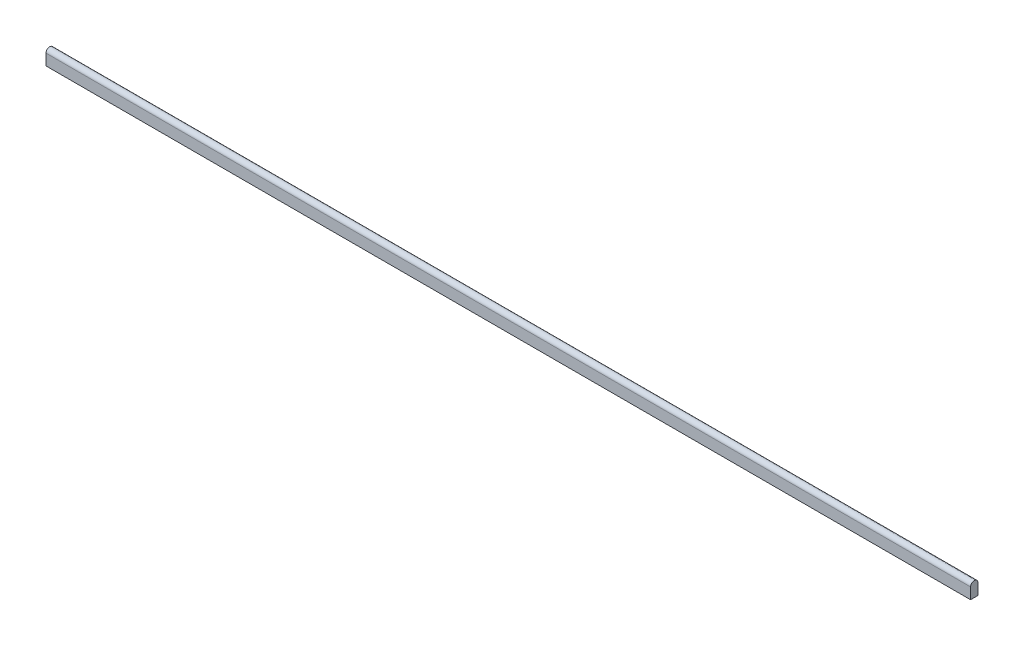
ISO-10303-21;
HEADER;
FILE_DESCRIPTION(('STEP AP214'),'2;1');
FILE_NAME('part.step','',(''),(''),'','','');
FILE_SCHEMA(('AUTOMOTIVE_DESIGN { 1 0 10303 214 1 1 1 1 }'));
ENDSEC;
DATA;
#1=APPLICATION_CONTEXT('core data for automotive mechanical design processes');
#2=APPLICATION_PROTOCOL_DEFINITION('international standard','automotive_design',2000,#1);
#3=PRODUCT_CONTEXT('',#1,'mechanical');
#4=PRODUCT('Part','Part','',(#3));
#5=PRODUCT_RELATED_PRODUCT_CATEGORY('part','',(#4));
#6=PRODUCT_DEFINITION_FORMATION('','',#4);
#7=PRODUCT_DEFINITION_CONTEXT('part definition',#1,'design');
#8=PRODUCT_DEFINITION('design','',#6,#7);
#9=PRODUCT_DEFINITION_SHAPE('','',#8);
#10=(LENGTH_UNIT() NAMED_UNIT(*) SI_UNIT(.MILLI.,.METRE.));
#11=(NAMED_UNIT(*) PLANE_ANGLE_UNIT() SI_UNIT($,.RADIAN.));
#12=(NAMED_UNIT(*) SI_UNIT($,.STERADIAN.) SOLID_ANGLE_UNIT());
#13=UNCERTAINTY_MEASURE_WITH_UNIT(LENGTH_MEASURE(1.E-05),#10,'distance_accuracy_value','');
#14=(GEOMETRIC_REPRESENTATION_CONTEXT(3) GLOBAL_UNCERTAINTY_ASSIGNED_CONTEXT((#13)) GLOBAL_UNIT_ASSIGNED_CONTEXT((#10,
#11,#12)) REPRESENTATION_CONTEXT('',''));
#15=CARTESIAN_POINT('',(0.,0.,0.));
#16=DIRECTION('',(0.,0.,1.));
#17=DIRECTION('',(1.,0.,0.));
#18=AXIS2_PLACEMENT_3D('',#15,#16,#17);
#19=CARTESIAN_POINT('',(500.,0.,0.));
#20=DIRECTION('',(-1.,0.,0.));
#21=DIRECTION('',(0.,0.,1.));
#22=AXIS2_PLACEMENT_3D('',#19,#20,#21);
#23=CYLINDRICAL_SURFACE('',#22,2.);
#24=CARTESIAN_POINT('',(0.,0.,0.));
#25=DIRECTION('',(1.,0.,0.));
#26=DIRECTION('',(0.,0.,1.));
#27=AXIS2_PLACEMENT_3D('',#24,#25,#26);
#28=CIRCLE('',#27,2.);
#29=CARTESIAN_POINT('',(0.,0.,-2.));
#30=VERTEX_POINT('',#29);
#31=CARTESIAN_POINT('',(0.,0.,2.));
#32=VERTEX_POINT('',#31);
#33=EDGE_CURVE('E96',#30,#32,#28,.T.);
#34=ORIENTED_EDGE('',*,*,#33,.T.);
#35=DIRECTION('',(-1.,0.,0.));
#36=VECTOR('',#35,1.);
#37=CARTESIAN_POINT('',(500.,0.,2.));
#38=LINE('',#37,#36);
#39=CARTESIAN_POINT('',(500.,0.,2.));
#40=VERTEX_POINT('',#39);
#41=EDGE_CURVE('E11',#40,#32,#38,.T.);
#42=ORIENTED_EDGE('',*,*,#41,.F.);
#43=CARTESIAN_POINT('',(500.,0.,0.));
#44=DIRECTION('',(1.,0.,0.));
#45=DIRECTION('',(0.,0.,1.));
#46=AXIS2_PLACEMENT_3D('',#43,#44,#45);
#47=CIRCLE('',#46,2.);
#48=CARTESIAN_POINT('',(500.,0.,-2.));
#49=VERTEX_POINT('',#48);
#50=EDGE_CURVE('E84',#49,#40,#47,.T.);
#51=ORIENTED_EDGE('',*,*,#50,.F.);
#52=DIRECTION('',(-1.,0.,0.));
#53=VECTOR('',#52,1.);
#54=CARTESIAN_POINT('',(500.,0.,-2.));
#55=LINE('',#54,#53);
#56=EDGE_CURVE('E92',#49,#30,#55,.T.);
#57=ORIENTED_EDGE('',*,*,#56,.T.);
#58=EDGE_LOOP('',(#34,#42,#51,#57));
#59=FACE_BOUND('',#58,.T.);
#60=ADVANCED_FACE('F33',(#59),#23,.T.);
#61=CARTESIAN_POINT('',(500.,0.,2.));
#62=DIRECTION('',(0.,0.,-1.));
#63=DIRECTION('',(0.,1.,0.));
#64=AXIS2_PLACEMENT_3D('',#61,#62,#63);
#65=PLANE('',#64);
#66=DIRECTION('',(0.,-1.,0.));
#67=VECTOR('',#66,1.);
#68=CARTESIAN_POINT('',(0.,0.,2.));
#69=LINE('',#68,#67);
#70=CARTESIAN_POINT('',(0.,-6.,2.));
#71=VERTEX_POINT('',#70);
#72=EDGE_CURVE('E88',#32,#71,#69,.T.);
#73=ORIENTED_EDGE('',*,*,#72,.T.);
#74=DIRECTION('',(-1.,0.,0.));
#75=VECTOR('',#74,1.);
#76=CARTESIAN_POINT('',(500.,-6.,2.));
#77=LINE('',#76,#75);
#78=CARTESIAN_POINT('',(500.,-6.,2.));
#79=VERTEX_POINT('',#78);
#80=EDGE_CURVE('E41',#79,#71,#77,.T.);
#81=ORIENTED_EDGE('',*,*,#80,.F.);
#82=DIRECTION('',(0.,-1.,0.));
#83=VECTOR('',#82,1.);
#84=CARTESIAN_POINT('',(500.,0.,2.));
#85=LINE('',#84,#83);
#86=EDGE_CURVE('E79',#40,#79,#85,.T.);
#87=ORIENTED_EDGE('',*,*,#86,.F.);
#88=ORIENTED_EDGE('',*,*,#41,.T.);
#89=EDGE_LOOP('',(#73,#81,#87,#88));
#90=FACE_BOUND('',#89,.T.);
#91=ADVANCED_FACE('F87',(#90),#65,.F.);
#92=CARTESIAN_POINT('',(500.,-6.,2.));
#93=DIRECTION('',(0.,1.,0.));
#94=DIRECTION('',(0.,0.,1.));
#95=AXIS2_PLACEMENT_3D('',#92,#93,#94);
#96=PLANE('',#95);
#97=DIRECTION('',(0.,0.,-1.));
#98=VECTOR('',#97,1.);
#99=CARTESIAN_POINT('',(0.,-6.,2.));
#100=LINE('',#99,#98);
#101=CARTESIAN_POINT('',(0.,-6.,-2.));
#102=VERTEX_POINT('',#101);
#103=EDGE_CURVE('E66',#71,#102,#100,.T.);
#104=ORIENTED_EDGE('',*,*,#103,.T.);
#105=DIRECTION('',(-1.,0.,0.));
#106=VECTOR('',#105,1.);
#107=CARTESIAN_POINT('',(500.,-6.,-2.));
#108=LINE('',#107,#106);
#109=CARTESIAN_POINT('',(500.,-6.,-2.));
#110=VERTEX_POINT('',#109);
#111=EDGE_CURVE('E89',#110,#102,#108,.T.);
#112=ORIENTED_EDGE('',*,*,#111,.F.);
#113=DIRECTION('',(0.,0.,-1.));
#114=VECTOR('',#113,1.);
#115=CARTESIAN_POINT('',(500.,-6.,2.));
#116=LINE('',#115,#114);
#117=EDGE_CURVE('E82',#79,#110,#116,.T.);
#118=ORIENTED_EDGE('',*,*,#117,.F.);
#119=ORIENTED_EDGE('',*,*,#80,.T.);
#120=EDGE_LOOP('',(#104,#112,#118,#119));
#121=FACE_BOUND('',#120,.T.);
#122=ADVANCED_FACE('F90',(#121),#96,.F.);
#123=CARTESIAN_POINT('',(500.,-6.,-2.));
#124=DIRECTION('',(0.,0.,1.));
#125=DIRECTION('',(0.,-1.,0.));
#126=AXIS2_PLACEMENT_3D('',#123,#124,#125);
#127=PLANE('',#126);
#128=DIRECTION('',(0.,1.,0.));
#129=VECTOR('',#128,1.);
#130=CARTESIAN_POINT('',(0.,-6.,-2.));
#131=LINE('',#130,#129);
#132=EDGE_CURVE('E72',#102,#30,#131,.T.);
#133=ORIENTED_EDGE('',*,*,#132,.T.);
#134=ORIENTED_EDGE('',*,*,#56,.F.);
#135=DIRECTION('',(0.,1.,0.));
#136=VECTOR('',#135,1.);
#137=CARTESIAN_POINT('',(500.,-6.,-2.));
#138=LINE('',#137,#136);
#139=EDGE_CURVE('E49',#110,#49,#138,.T.);
#140=ORIENTED_EDGE('',*,*,#139,.F.);
#141=ORIENTED_EDGE('',*,*,#111,.T.);
#142=EDGE_LOOP('',(#133,#134,#140,#141));
#143=FACE_BOUND('',#142,.T.);
#144=ADVANCED_FACE('F103',(#143),#127,.F.);
#145=CARTESIAN_POINT('',(500.,0.,0.));
#146=DIRECTION('',(-1.,0.,0.));
#147=DIRECTION('',(0.,0.,1.));
#148=AXIS2_PLACEMENT_3D('',#145,#146,#147);
#149=PLANE('',#148);
#150=ORIENTED_EDGE('',*,*,#50,.T.);
#151=ORIENTED_EDGE('',*,*,#86,.T.);
#152=ORIENTED_EDGE('',*,*,#117,.T.);
#153=ORIENTED_EDGE('',*,*,#139,.T.);
#154=EDGE_LOOP('',(#150,#151,#152,#153));
#155=FACE_BOUND('',#154,.T.);
#156=ADVANCED_FACE('F80',(#155),#149,.F.);
#157=CARTESIAN_POINT('',(0.,0.,0.));
#158=DIRECTION('',(-1.,0.,0.));
#159=DIRECTION('',(0.,0.,1.));
#160=AXIS2_PLACEMENT_3D('',#157,#158,#159);
#161=PLANE('',#160);
#162=ORIENTED_EDGE('',*,*,#33,.F.);
#163=ORIENTED_EDGE('',*,*,#132,.F.);
#164=ORIENTED_EDGE('',*,*,#103,.F.);
#165=ORIENTED_EDGE('',*,*,#72,.F.);
#166=EDGE_LOOP('',(#162,#163,#164,#165));
#167=FACE_BOUND('',#166,.T.);
#168=ADVANCED_FACE('F106',(#167),#161,.T.);
#169=CLOSED_SHELL('',(#60,#91,#122,#144,#156,#168));
#170=MANIFOLD_SOLID_BREP('B2',#169);
#171=ADVANCED_BREP_SHAPE_REPRESENTATION('',(#18,#170),#14);
#172=SHAPE_DEFINITION_REPRESENTATION(#9,#171);
ENDSEC;
END-ISO-10303-21;
